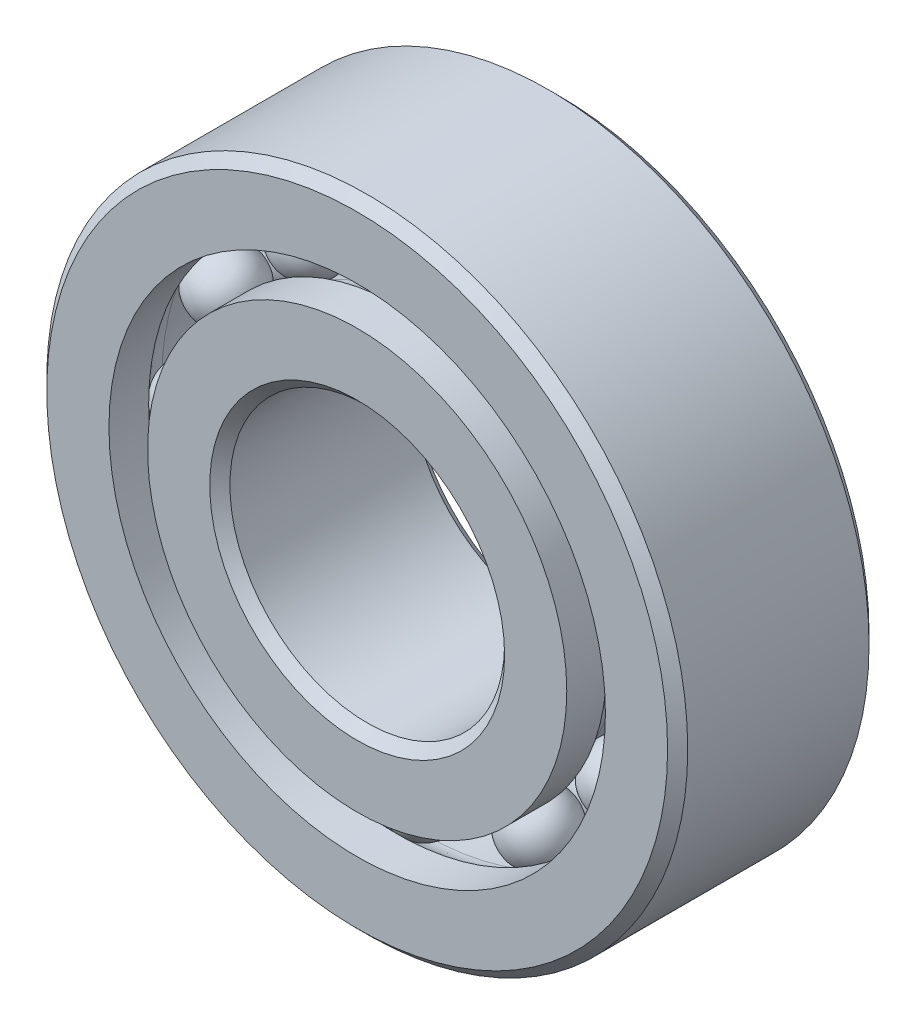
ISO-10303-21;
HEADER;
FILE_DESCRIPTION(('STEP AP214'),'2;1');
FILE_NAME('part.step','',(''),(''),'','','');
FILE_SCHEMA(('AUTOMOTIVE_DESIGN { 1 0 10303 214 1 1 1 1 }'));
ENDSEC;
DATA;
#1=APPLICATION_CONTEXT('core data for automotive mechanical design processes');
#2=APPLICATION_PROTOCOL_DEFINITION('international standard','automotive_design',2000,#1);
#3=PRODUCT_CONTEXT('',#1,'mechanical');
#4=PRODUCT('Part','Part','',(#3));
#5=PRODUCT_RELATED_PRODUCT_CATEGORY('part','',(#4));
#6=PRODUCT_DEFINITION_FORMATION('','',#4);
#7=PRODUCT_DEFINITION_CONTEXT('part definition',#1,'design');
#8=PRODUCT_DEFINITION('design','',#6,#7);
#9=PRODUCT_DEFINITION_SHAPE('','',#8);
#10=(LENGTH_UNIT() NAMED_UNIT(*) SI_UNIT(.MILLI.,.METRE.));
#11=(NAMED_UNIT(*) PLANE_ANGLE_UNIT() SI_UNIT($,.RADIAN.));
#12=(NAMED_UNIT(*) SI_UNIT($,.STERADIAN.) SOLID_ANGLE_UNIT());
#13=UNCERTAINTY_MEASURE_WITH_UNIT(LENGTH_MEASURE(1.E-05),#10,'distance_accuracy_value','');
#14=(GEOMETRIC_REPRESENTATION_CONTEXT(3) GLOBAL_UNCERTAINTY_ASSIGNED_CONTEXT((#13)) GLOBAL_UNIT_ASSIGNED_CONTEXT((#10,
#11,#12)) REPRESENTATION_CONTEXT('',''));
#15=CARTESIAN_POINT('',(0.,0.,0.));
#16=DIRECTION('',(0.,0.,1.));
#17=DIRECTION('',(1.,0.,0.));
#18=AXIS2_PLACEMENT_3D('',#15,#16,#17);
#19=CARTESIAN_POINT('',(-6.24999999999986,10.8253175473056,-1.83333333333333));
#20=DIRECTION('',(0.,0.,1.));
#21=DIRECTION('',(-0.499999999999989,0.866025403784445,0.));
#22=AXIS2_PLACEMENT_3D('',#19,#20,#21);
#23=SPHERICAL_SURFACE('',#22,1.83333333333333);
#24=CARTESIAN_POINT('',(-6.24999999999986,10.8253175473056,0.));
#25=VERTEX_POINT('',#24);
#26=VERTEX_LOOP('',#25);
#27=FACE_BOUND('',#26,.T.);
#28=ADVANCED_FACE('F42',(#27),#23,.T.);
#29=CLOSED_SHELL('',(#28));
#30=MANIFOLD_SOLID_BREP('B2',#29);
#31=CARTESIAN_POINT('',(-10.8253175473054,6.25000000000013,-1.83333333333333));
#32=DIRECTION('',(0.,0.,1.));
#33=DIRECTION('',(-0.866025403784433,0.50000000000001,0.));
#34=AXIS2_PLACEMENT_3D('',#31,#32,#33);
#35=SPHERICAL_SURFACE('',#34,1.83333333333333);
#36=CARTESIAN_POINT('',(-10.8253175473054,6.25000000000013,0.));
#37=VERTEX_POINT('',#36);
#38=VERTEX_LOOP('',#37);
#39=FACE_BOUND('',#38,.T.);
#40=ADVANCED_FACE('F63',(#39),#35,.T.);
#41=CLOSED_SHELL('',(#40));
#42=MANIFOLD_SOLID_BREP('B6',#41);
#43=CARTESIAN_POINT('',(-12.5,1.30930550206618E-13,-1.83333333333333));
#44=DIRECTION('',(0.,0.,1.));
#45=DIRECTION('',(-1.,0.,0.));
#46=AXIS2_PLACEMENT_3D('',#43,#44,#45);
#47=SPHERICAL_SURFACE('',#46,1.83333333333333);
#48=CARTESIAN_POINT('',(-12.5,1.30930550206618E-13,0.));
#49=VERTEX_POINT('',#48);
#50=VERTEX_LOOP('',#49);
#51=FACE_BOUND('',#50,.T.);
#52=ADVANCED_FACE('F84',(#51),#47,.T.);
#53=CLOSED_SHELL('',(#52));
#54=MANIFOLD_SOLID_BREP('B38',#53);
#55=CARTESIAN_POINT('',(-10.8253175473055,-6.2499999999999,-1.83333333333333));
#56=DIRECTION('',(0.,0.,1.));
#57=DIRECTION('',(-0.866025403784443,-0.499999999999992,0.));
#58=AXIS2_PLACEMENT_3D('',#55,#56,#57);
#59=SPHERICAL_SURFACE('',#58,1.83333333333333);
#60=CARTESIAN_POINT('',(-10.8253175473055,-6.2499999999999,0.));
#61=VERTEX_POINT('',#60);
#62=VERTEX_LOOP('',#61);
#63=FACE_BOUND('',#62,.T.);
#64=ADVANCED_FACE('F105',(#63),#59,.T.);
#65=CLOSED_SHELL('',(#64));
#66=MANIFOLD_SOLID_BREP('B59',#65);
#67=CARTESIAN_POINT('',(-6.25000000000009,-10.8253175473054,-1.83333333333333));
#68=DIRECTION('',(0.,0.,1.));
#69=DIRECTION('',(-0.500000000000007,-0.866025403784435,0.));
#70=AXIS2_PLACEMENT_3D('',#67,#68,#69);
#71=SPHERICAL_SURFACE('',#70,1.83333333333333);
#72=CARTESIAN_POINT('',(-6.25000000000009,-10.8253175473054,0.));
#73=VERTEX_POINT('',#72);
#74=VERTEX_LOOP('',#73);
#75=FACE_BOUND('',#74,.T.);
#76=ADVANCED_FACE('F126',(#75),#71,.T.);
#77=CLOSED_SHELL('',(#76));
#78=MANIFOLD_SOLID_BREP('B80',#77);
#79=CARTESIAN_POINT('',(0.,-12.5,-1.83333333333333));
#80=DIRECTION('',(0.,0.,1.));
#81=DIRECTION('',(0.,-1.,0.));
#82=AXIS2_PLACEMENT_3D('',#79,#80,#81);
#83=SPHERICAL_SURFACE('',#82,1.83333333333333);
#84=CARTESIAN_POINT('',(0.,-12.5,0.));
#85=VERTEX_POINT('',#84);
#86=VERTEX_LOOP('',#85);
#87=FACE_BOUND('',#86,.T.);
#88=ADVANCED_FACE('F147',(#87),#83,.T.);
#89=CLOSED_SHELL('',(#88));
#90=MANIFOLD_SOLID_BREP('B101',#89);
#91=CARTESIAN_POINT('',(6.24999999999994,-10.8253175473055,-1.83333333333333));
#92=DIRECTION('',(0.,0.,1.));
#93=DIRECTION('',(0.499999999999995,-0.866025403784442,0.));
#94=AXIS2_PLACEMENT_3D('',#91,#92,#93);
#95=SPHERICAL_SURFACE('',#94,1.83333333333333);
#96=CARTESIAN_POINT('',(6.24999999999994,-10.8253175473055,0.));
#97=VERTEX_POINT('',#96);
#98=VERTEX_LOOP('',#97);
#99=FACE_BOUND('',#98,.T.);
#100=ADVANCED_FACE('F168',(#99),#95,.T.);
#101=CLOSED_SHELL('',(#100));
#102=MANIFOLD_SOLID_BREP('B122',#101);
#103=CARTESIAN_POINT('',(10.8253175473055,-6.25000000000005,-1.83333333333333));
#104=DIRECTION('',(0.,0.,1.));
#105=DIRECTION('',(0.866025403784436,-0.500000000000004,0.));
#106=AXIS2_PLACEMENT_3D('',#103,#104,#105);
#107=SPHERICAL_SURFACE('',#106,1.83333333333333);
#108=CARTESIAN_POINT('',(10.8253175473055,-6.25000000000005,0.));
#109=VERTEX_POINT('',#108);
#110=VERTEX_LOOP('',#109);
#111=FACE_BOUND('',#110,.T.);
#112=ADVANCED_FACE('F189',(#111),#107,.T.);
#113=CLOSED_SHELL('',(#112));
#114=MANIFOLD_SOLID_BREP('B143',#113);
#115=CARTESIAN_POINT('',(12.5,0.,-1.83333333333333));
#116=DIRECTION('',(0.,0.,1.));
#117=DIRECTION('',(1.,0.,0.));
#118=AXIS2_PLACEMENT_3D('',#115,#116,#117);
#119=SPHERICAL_SURFACE('',#118,1.83333333333333);
#120=CARTESIAN_POINT('',(12.5,0.,0.));
#121=VERTEX_POINT('',#120);
#122=VERTEX_LOOP('',#121);
#123=FACE_BOUND('',#122,.T.);
#124=ADVANCED_FACE('F210',(#123),#119,.T.);
#125=CLOSED_SHELL('',(#124));
#126=MANIFOLD_SOLID_BREP('B164',#125);
#127=CARTESIAN_POINT('',(10.8253175473055,6.24999999999998,-1.83333333333333));
#128=DIRECTION('',(0.,0.,1.));
#129=DIRECTION('',(0.86602540378444,0.499999999999998,0.));
#130=AXIS2_PLACEMENT_3D('',#127,#128,#129);
#131=SPHERICAL_SURFACE('',#130,1.83333333333333);
#132=CARTESIAN_POINT('',(10.8253175473055,6.24999999999998,0.));
#133=VERTEX_POINT('',#132);
#134=VERTEX_LOOP('',#133);
#135=FACE_BOUND('',#134,.T.);
#136=ADVANCED_FACE('F231',(#135),#131,.T.);
#137=CLOSED_SHELL('',(#136));
#138=MANIFOLD_SOLID_BREP('B185',#137);
#139=CARTESIAN_POINT('',(6.25000000000001,10.8253175473055,-1.83333333333333));
#140=DIRECTION('',(0.,0.,1.));
#141=DIRECTION('',(0.500000000000001,0.866025403784438,0.));
#142=AXIS2_PLACEMENT_3D('',#139,#140,#141);
#143=SPHERICAL_SURFACE('',#142,1.83333333333333);
#144=CARTESIAN_POINT('',(6.25000000000001,10.8253175473055,0.));
#145=VERTEX_POINT('',#144);
#146=VERTEX_LOOP('',#145);
#147=FACE_BOUND('',#146,.T.);
#148=ADVANCED_FACE('F252',(#147),#143,.T.);
#149=CLOSED_SHELL('',(#148));
#150=MANIFOLD_SOLID_BREP('B206',#149);
#151=CARTESIAN_POINT('',(-6.24999999999986,10.8253175473056,1.83333333333333));
#152=DIRECTION('',(0.,0.,-1.));
#153=DIRECTION('',(-0.499999999999989,0.866025403784445,0.));
#154=AXIS2_PLACEMENT_3D('',#151,#152,#153);
#155=SPHERICAL_SURFACE('',#154,1.83333333333333);
#156=CARTESIAN_POINT('',(-6.24999999999986,10.8253175473056,0.));
#157=VERTEX_POINT('',#156);
#158=VERTEX_LOOP('',#157);
#159=FACE_BOUND('',#158,.T.);
#160=ADVANCED_FACE('F273',(#159),#155,.T.);
#161=CLOSED_SHELL('',(#160));
#162=MANIFOLD_SOLID_BREP('B227',#161);
#163=CARTESIAN_POINT('',(-10.8253175473054,6.25000000000013,1.83333333333333));
#164=DIRECTION('',(0.,0.,-1.));
#165=DIRECTION('',(-0.866025403784433,0.50000000000001,0.));
#166=AXIS2_PLACEMENT_3D('',#163,#164,#165);
#167=SPHERICAL_SURFACE('',#166,1.83333333333333);
#168=CARTESIAN_POINT('',(-10.8253175473054,6.25000000000013,0.));
#169=VERTEX_POINT('',#168);
#170=VERTEX_LOOP('',#169);
#171=FACE_BOUND('',#170,.T.);
#172=ADVANCED_FACE('F294',(#171),#167,.T.);
#173=CLOSED_SHELL('',(#172));
#174=MANIFOLD_SOLID_BREP('B248',#173);
#175=CARTESIAN_POINT('',(-12.5,1.30930550206618E-13,1.83333333333333));
#176=DIRECTION('',(0.,0.,-1.));
#177=DIRECTION('',(-1.,0.,0.));
#178=AXIS2_PLACEMENT_3D('',#175,#176,#177);
#179=SPHERICAL_SURFACE('',#178,1.83333333333333);
#180=CARTESIAN_POINT('',(-12.5,1.30930550206618E-13,0.));
#181=VERTEX_POINT('',#180);
#182=VERTEX_LOOP('',#181);
#183=FACE_BOUND('',#182,.T.);
#184=ADVANCED_FACE('F315',(#183),#179,.T.);
#185=CLOSED_SHELL('',(#184));
#186=MANIFOLD_SOLID_BREP('B269',#185);
#187=CARTESIAN_POINT('',(-10.8253175473055,-6.2499999999999,1.83333333333333));
#188=DIRECTION('',(0.,0.,-1.));
#189=DIRECTION('',(-0.866025403784443,-0.499999999999992,0.));
#190=AXIS2_PLACEMENT_3D('',#187,#188,#189);
#191=SPHERICAL_SURFACE('',#190,1.83333333333333);
#192=CARTESIAN_POINT('',(-10.8253175473055,-6.2499999999999,0.));
#193=VERTEX_POINT('',#192);
#194=VERTEX_LOOP('',#193);
#195=FACE_BOUND('',#194,.T.);
#196=ADVANCED_FACE('F336',(#195),#191,.T.);
#197=CLOSED_SHELL('',(#196));
#198=MANIFOLD_SOLID_BREP('B290',#197);
#199=CARTESIAN_POINT('',(-6.25000000000009,-10.8253175473054,1.83333333333333));
#200=DIRECTION('',(0.,0.,-1.));
#201=DIRECTION('',(-0.500000000000007,-0.866025403784435,0.));
#202=AXIS2_PLACEMENT_3D('',#199,#200,#201);
#203=SPHERICAL_SURFACE('',#202,1.83333333333333);
#204=CARTESIAN_POINT('',(-6.25000000000009,-10.8253175473054,0.));
#205=VERTEX_POINT('',#204);
#206=VERTEX_LOOP('',#205);
#207=FACE_BOUND('',#206,.T.);
#208=ADVANCED_FACE('F357',(#207),#203,.T.);
#209=CLOSED_SHELL('',(#208));
#210=MANIFOLD_SOLID_BREP('B311',#209);
#211=CARTESIAN_POINT('',(0.,-12.5,1.83333333333333));
#212=DIRECTION('',(0.,0.,-1.));
#213=DIRECTION('',(0.,-1.,0.));
#214=AXIS2_PLACEMENT_3D('',#211,#212,#213);
#215=SPHERICAL_SURFACE('',#214,1.83333333333333);
#216=CARTESIAN_POINT('',(0.,-12.5,0.));
#217=VERTEX_POINT('',#216);
#218=VERTEX_LOOP('',#217);
#219=FACE_BOUND('',#218,.T.);
#220=ADVANCED_FACE('F378',(#219),#215,.T.);
#221=CLOSED_SHELL('',(#220));
#222=MANIFOLD_SOLID_BREP('B332',#221);
#223=CARTESIAN_POINT('',(6.24999999999994,-10.8253175473055,1.83333333333333));
#224=DIRECTION('',(0.,0.,-1.));
#225=DIRECTION('',(0.499999999999995,-0.866025403784442,0.));
#226=AXIS2_PLACEMENT_3D('',#223,#224,#225);
#227=SPHERICAL_SURFACE('',#226,1.83333333333333);
#228=CARTESIAN_POINT('',(6.24999999999994,-10.8253175473055,0.));
#229=VERTEX_POINT('',#228);
#230=VERTEX_LOOP('',#229);
#231=FACE_BOUND('',#230,.T.);
#232=ADVANCED_FACE('F399',(#231),#227,.T.);
#233=CLOSED_SHELL('',(#232));
#234=MANIFOLD_SOLID_BREP('B353',#233);
#235=CARTESIAN_POINT('',(10.8253175473055,-6.25000000000005,1.83333333333333));
#236=DIRECTION('',(0.,0.,-1.));
#237=DIRECTION('',(0.866025403784436,-0.500000000000004,0.));
#238=AXIS2_PLACEMENT_3D('',#235,#236,#237);
#239=SPHERICAL_SURFACE('',#238,1.83333333333333);
#240=CARTESIAN_POINT('',(10.8253175473055,-6.25000000000005,0.));
#241=VERTEX_POINT('',#240);
#242=VERTEX_LOOP('',#241);
#243=FACE_BOUND('',#242,.T.);
#244=ADVANCED_FACE('F420',(#243),#239,.T.);
#245=CLOSED_SHELL('',(#244));
#246=MANIFOLD_SOLID_BREP('B374',#245);
#247=CARTESIAN_POINT('',(12.5,0.,1.83333333333333));
#248=DIRECTION('',(0.,0.,-1.));
#249=DIRECTION('',(1.,0.,0.));
#250=AXIS2_PLACEMENT_3D('',#247,#248,#249);
#251=SPHERICAL_SURFACE('',#250,1.83333333333333);
#252=CARTESIAN_POINT('',(12.5,0.,0.));
#253=VERTEX_POINT('',#252);
#254=VERTEX_LOOP('',#253);
#255=FACE_BOUND('',#254,.T.);
#256=ADVANCED_FACE('F441',(#255),#251,.T.);
#257=CLOSED_SHELL('',(#256));
#258=MANIFOLD_SOLID_BREP('B395',#257);
#259=CARTESIAN_POINT('',(10.8253175473055,6.24999999999998,1.83333333333333));
#260=DIRECTION('',(0.,0.,-1.));
#261=DIRECTION('',(0.86602540378444,0.499999999999998,0.));
#262=AXIS2_PLACEMENT_3D('',#259,#260,#261);
#263=SPHERICAL_SURFACE('',#262,1.83333333333333);
#264=CARTESIAN_POINT('',(10.8253175473055,6.24999999999998,0.));
#265=VERTEX_POINT('',#264);
#266=VERTEX_LOOP('',#265);
#267=FACE_BOUND('',#266,.T.);
#268=ADVANCED_FACE('F462',(#267),#263,.T.);
#269=CLOSED_SHELL('',(#268));
#270=MANIFOLD_SOLID_BREP('B416',#269);
#271=CARTESIAN_POINT('',(6.25000000000001,10.8253175473055,1.83333333333333));
#272=DIRECTION('',(0.,0.,-1.));
#273=DIRECTION('',(0.500000000000001,0.866025403784438,0.));
#274=AXIS2_PLACEMENT_3D('',#271,#272,#273);
#275=SPHERICAL_SURFACE('',#274,1.83333333333333);
#276=CARTESIAN_POINT('',(6.25000000000001,10.8253175473055,0.));
#277=VERTEX_POINT('',#276);
#278=VERTEX_LOOP('',#277);
#279=FACE_BOUND('',#278,.T.);
#280=ADVANCED_FACE('F483',(#279),#275,.T.);
#281=CLOSED_SHELL('',(#280));
#282=MANIFOLD_SOLID_BREP('B437',#281);
#283=CARTESIAN_POINT('',(0.,12.5,1.83333333333333));
#284=DIRECTION('',(0.,0.,-1.));
#285=DIRECTION('',(0.,1.,0.));
#286=AXIS2_PLACEMENT_3D('',#283,#284,#285);
#287=SPHERICAL_SURFACE('',#286,1.83333333333333);
#288=CARTESIAN_POINT('',(0.,12.5,0.));
#289=VERTEX_POINT('',#288);
#290=VERTEX_LOOP('',#289);
#291=FACE_BOUND('',#290,.T.);
#292=ADVANCED_FACE('F504',(#291),#287,.T.);
#293=CLOSED_SHELL('',(#292));
#294=MANIFOLD_SOLID_BREP('B458',#293);
#295=CARTESIAN_POINT('',(0.,12.5,-1.83333333333333));
#296=DIRECTION('',(0.,0.,1.));
#297=DIRECTION('',(0.,1.,0.));
#298=AXIS2_PLACEMENT_3D('',#295,#296,#297);
#299=SPHERICAL_SURFACE('',#298,1.83333333333333);
#300=CARTESIAN_POINT('',(0.,12.5,0.));
#301=VERTEX_POINT('',#300);
#302=VERTEX_LOOP('',#301);
#303=FACE_BOUND('',#302,.T.);
#304=ADVANCED_FACE('F527',(#303),#299,.T.);
#305=CLOSED_SHELL('',(#304));
#306=MANIFOLD_SOLID_BREP('B479',#305);
#307=CARTESIAN_POINT('',(0.,11.4450549450549,5.5));
#308=DIRECTION('',(0.,0.,-1.));
#309=DIRECTION('',(-1.,0.,0.));
#310=AXIS2_PLACEMENT_3D('',#307,#308,#309);
#311=PLANE('',#310);
#312=CARTESIAN_POINT('',(0.,0.,5.5));
#313=DIRECTION('',(0.,0.,1.));
#314=DIRECTION('',(1.,0.,0.));
#315=AXIS2_PLACEMENT_3D('',#312,#313,#314);
#316=CIRCLE('',#315,8.05);
#317=CARTESIAN_POINT('',(8.05,0.,5.5));
#318=VERTEX_POINT('',#317);
#319=EDGE_CURVE('E526',#318,#318,#316,.T.);
#320=ORIENTED_EDGE('',*,*,#319,.F.);
#321=EDGE_LOOP('',(#320));
#322=FACE_BOUND('',#321,.T.);
#323=CARTESIAN_POINT('',(0.,0.,5.5));
#324=DIRECTION('',(0.,0.,1.));
#325=DIRECTION('',(1.,0.,0.));
#326=AXIS2_PLACEMENT_3D('',#323,#324,#325);
#327=CIRCLE('',#326,11.4450549450549);
#328=CARTESIAN_POINT('',(11.4450549450549,0.,5.5));
#329=VERTEX_POINT('',#328);
#330=EDGE_CURVE('E581',#329,#329,#327,.T.);
#331=ORIENTED_EDGE('',*,*,#330,.T.);
#332=EDGE_LOOP('',(#331));
#333=FACE_BOUND('',#332,.T.);
#334=ADVANCED_FACE('F547',(#322,#333),#311,.F.);
#335=CARTESIAN_POINT('',(0.,0.,5.5));
#336=DIRECTION('',(0.,0.,1.));
#337=DIRECTION('',(1.,0.,0.));
#338=AXIS2_PLACEMENT_3D('',#335,#336,#337);
#339=CONICAL_SURFACE('',#338,8.05,0.78539816339745);
#340=CARTESIAN_POINT('',(0.,0.,4.95));
#341=DIRECTION('',(0.,0.,1.));
#342=DIRECTION('',(1.,0.,0.));
#343=AXIS2_PLACEMENT_3D('',#340,#341,#342);
#344=CIRCLE('',#343,7.5);
#345=CARTESIAN_POINT('',(7.5,0.,4.95));
#346=VERTEX_POINT('',#345);
#347=EDGE_CURVE('E553',#346,#346,#344,.T.);
#348=ORIENTED_EDGE('',*,*,#347,.F.);
#349=EDGE_LOOP('',(#348));
#350=FACE_BOUND('',#349,.T.);
#351=ORIENTED_EDGE('',*,*,#319,.T.);
#352=EDGE_LOOP('',(#351));
#353=FACE_BOUND('',#352,.T.);
#354=ADVANCED_FACE('F630',(#350,#353),#339,.F.);
#355=CARTESIAN_POINT('',(0.,0.,5.5));
#356=DIRECTION('',(0.,0.,1.));
#357=DIRECTION('',(1.,0.,0.));
#358=AXIS2_PLACEMENT_3D('',#355,#356,#357);
#359=CYLINDRICAL_SURFACE('',#358,7.5);
#360=CARTESIAN_POINT('',(0.,0.,-4.95));
#361=DIRECTION('',(0.,0.,1.));
#362=DIRECTION('',(1.,0.,0.));
#363=AXIS2_PLACEMENT_3D('',#360,#361,#362);
#364=CIRCLE('',#363,7.5);
#365=CARTESIAN_POINT('',(7.5,0.,-4.95));
#366=VERTEX_POINT('',#365);
#367=EDGE_CURVE('E557',#366,#366,#364,.T.);
#368=ORIENTED_EDGE('',*,*,#367,.F.);
#369=EDGE_LOOP('',(#368));
#370=FACE_BOUND('',#369,.T.);
#371=ORIENTED_EDGE('',*,*,#347,.T.);
#372=EDGE_LOOP('',(#371));
#373=FACE_BOUND('',#372,.T.);
#374=ADVANCED_FACE('F625',(#370,#373),#359,.F.);
#375=CARTESIAN_POINT('',(0.,0.,-4.95));
#376=DIRECTION('',(0.,0.,-1.));
#377=DIRECTION('',(-1.,0.,0.));
#378=AXIS2_PLACEMENT_3D('',#375,#376,#377);
#379=CONICAL_SURFACE('',#378,7.5,0.78539816339745);
#380=CARTESIAN_POINT('',(0.,0.,-5.5));
#381=DIRECTION('',(0.,0.,1.));
#382=DIRECTION('',(1.,0.,0.));
#383=AXIS2_PLACEMENT_3D('',#380,#381,#382);
#384=CIRCLE('',#383,8.05);
#385=CARTESIAN_POINT('',(8.05,0.,-5.5));
#386=VERTEX_POINT('',#385);
#387=EDGE_CURVE('E561',#386,#386,#384,.T.);
#388=ORIENTED_EDGE('',*,*,#387,.F.);
#389=EDGE_LOOP('',(#388));
#390=FACE_BOUND('',#389,.T.);
#391=ORIENTED_EDGE('',*,*,#367,.T.);
#392=EDGE_LOOP('',(#391));
#393=FACE_BOUND('',#392,.T.);
#394=ADVANCED_FACE('F619',(#390,#393),#379,.F.);
#395=CARTESIAN_POINT('',(0.,8.05,-5.5));
#396=DIRECTION('',(0.,0.,1.));
#397=DIRECTION('',(1.,0.,0.));
#398=AXIS2_PLACEMENT_3D('',#395,#396,#397);
#399=PLANE('',#398);
#400=CARTESIAN_POINT('',(0.,0.,-5.5));
#401=DIRECTION('',(0.,0.,1.));
#402=DIRECTION('',(1.,0.,0.));
#403=AXIS2_PLACEMENT_3D('',#400,#401,#402);
#404=CIRCLE('',#403,11.445054945055);
#405=CARTESIAN_POINT('',(11.445054945055,0.,-5.5));
#406=VERTEX_POINT('',#405);
#407=EDGE_CURVE('E566',#406,#406,#404,.T.);
#408=ORIENTED_EDGE('',*,*,#407,.F.);
#409=EDGE_LOOP('',(#408));
#410=FACE_BOUND('',#409,.T.);
#411=ORIENTED_EDGE('',*,*,#387,.T.);
#412=EDGE_LOOP('',(#411));
#413=FACE_BOUND('',#412,.T.);
#414=ADVANCED_FACE('F613',(#410,#413),#399,.F.);
#415=CARTESIAN_POINT('',(0.,0.,5.5));
#416=DIRECTION('',(0.,0.,1.));
#417=DIRECTION('',(1.,0.,0.));
#418=AXIS2_PLACEMENT_3D('',#415,#416,#417);
#419=CYLINDRICAL_SURFACE('',#418,11.445054945055);
#420=CARTESIAN_POINT('',(0.,0.,-3.33273389427697));
#421=DIRECTION('',(0.,0.,1.));
#422=DIRECTION('',(1.,0.,0.));
#423=AXIS2_PLACEMENT_3D('',#420,#421,#422);
#424=CIRCLE('',#423,11.445054945055);
#425=CARTESIAN_POINT('',(11.445054945055,0.,-3.33273389427697));
#426=VERTEX_POINT('',#425);
#427=EDGE_CURVE('E569',#426,#426,#424,.T.);
#428=ORIENTED_EDGE('',*,*,#427,.F.);
#429=EDGE_LOOP('',(#428));
#430=FACE_BOUND('',#429,.T.);
#431=ORIENTED_EDGE('',*,*,#407,.T.);
#432=EDGE_LOOP('',(#431));
#433=FACE_BOUND('',#432,.T.);
#434=ADVANCED_FACE('F607',(#430,#433),#419,.T.);
#435=CARTESIAN_POINT('',(0.,0.,-1.83333333333333));
#436=DIRECTION('',(0.,0.,1.));
#437=DIRECTION('',(1.,0.,0.));
#438=AXIS2_PLACEMENT_3D('',#435,#436,#437);
#439=TOROIDAL_SURFACE('',#438,12.5,1.83333333333333);
#440=CARTESIAN_POINT('',(0.,0.,-1.83333333333333));
#441=DIRECTION('',(0.,0.,1.));
#442=DIRECTION('',(1.,0.,0.));
#443=AXIS2_PLACEMENT_3D('',#440,#441,#442);
#444=CIRCLE('',#443,10.6666666666667);
#445=CARTESIAN_POINT('',(10.6666666666667,0.,-1.83333333333333));
#446=VERTEX_POINT('',#445);
#447=EDGE_CURVE('E572',#446,#446,#444,.T.);
#448=ORIENTED_EDGE('',*,*,#447,.F.);
#449=EDGE_LOOP('',(#448));
#450=FACE_BOUND('',#449,.T.);
#451=ORIENTED_EDGE('',*,*,#427,.T.);
#452=EDGE_LOOP('',(#451));
#453=FACE_BOUND('',#452,.T.);
#454=ADVANCED_FACE('F601',(#450,#453),#439,.F.);
#455=CARTESIAN_POINT('',(0.,0.,5.5));
#456=DIRECTION('',(0.,0.,1.));
#457=DIRECTION('',(1.,0.,0.));
#458=AXIS2_PLACEMENT_3D('',#455,#456,#457);
#459=CYLINDRICAL_SURFACE('',#458,10.6666666666667);
#460=CARTESIAN_POINT('',(0.,0.,1.83333333333333));
#461=DIRECTION('',(0.,0.,1.));
#462=DIRECTION('',(1.,0.,0.));
#463=AXIS2_PLACEMENT_3D('',#460,#461,#462);
#464=CIRCLE('',#463,10.6666666666667);
#465=CARTESIAN_POINT('',(10.6666666666667,0.,1.83333333333333));
#466=VERTEX_POINT('',#465);
#467=EDGE_CURVE('E575',#466,#466,#464,.T.);
#468=ORIENTED_EDGE('',*,*,#467,.F.);
#469=EDGE_LOOP('',(#468));
#470=FACE_BOUND('',#469,.T.);
#471=ORIENTED_EDGE('',*,*,#447,.T.);
#472=EDGE_LOOP('',(#471));
#473=FACE_BOUND('',#472,.T.);
#474=ADVANCED_FACE('F595',(#470,#473),#459,.T.);
#475=CARTESIAN_POINT('',(0.,0.,1.83333333333333));
#476=DIRECTION('',(0.,0.,1.));
#477=DIRECTION('',(1.,0.,0.));
#478=AXIS2_PLACEMENT_3D('',#475,#476,#477);
#479=TOROIDAL_SURFACE('',#478,12.5,1.83333333333333);
#480=CARTESIAN_POINT('',(0.,0.,3.33273389427697));
#481=DIRECTION('',(0.,0.,1.));
#482=DIRECTION('',(1.,0.,0.));
#483=AXIS2_PLACEMENT_3D('',#480,#481,#482);
#484=CIRCLE('',#483,11.4450549450549);
#485=CARTESIAN_POINT('',(11.4450549450549,0.,3.33273389427697));
#486=VERTEX_POINT('',#485);
#487=EDGE_CURVE('E578',#486,#486,#484,.T.);
#488=ORIENTED_EDGE('',*,*,#487,.F.);
#489=EDGE_LOOP('',(#488));
#490=FACE_BOUND('',#489,.T.);
#491=ORIENTED_EDGE('',*,*,#467,.T.);
#492=EDGE_LOOP('',(#491));
#493=FACE_BOUND('',#492,.T.);
#494=ADVANCED_FACE('F589',(#490,#493),#479,.F.);
#495=CARTESIAN_POINT('',(0.,0.,5.5));
#496=DIRECTION('',(0.,0.,1.));
#497=DIRECTION('',(1.,0.,0.));
#498=AXIS2_PLACEMENT_3D('',#495,#496,#497);
#499=CYLINDRICAL_SURFACE('',#498,11.4450549450549);
#500=ORIENTED_EDGE('',*,*,#330,.F.);
#501=EDGE_LOOP('',(#500));
#502=FACE_BOUND('',#501,.T.);
#503=ORIENTED_EDGE('',*,*,#487,.T.);
#504=EDGE_LOOP('',(#503));
#505=FACE_BOUND('',#504,.T.);
#506=ADVANCED_FACE('F586',(#502,#505),#499,.T.);
#507=CLOSED_SHELL('',(#334,#354,#374,#394,#414,#434,#454,#474,#494,#506));
#508=MANIFOLD_SOLID_BREP('B500',#507);
#509=CARTESIAN_POINT('',(0.,0.,4.95));
#510=DIRECTION('',(0.,0.,-1.));
#511=DIRECTION('',(-1.,0.,0.));
#512=AXIS2_PLACEMENT_3D('',#509,#510,#511);
#513=CONICAL_SURFACE('',#512,17.5,0.785398163397447);
#514=CARTESIAN_POINT('',(0.,0.,5.5));
#515=DIRECTION('',(0.,0.,1.));
#516=DIRECTION('',(1.,0.,0.));
#517=AXIS2_PLACEMENT_3D('',#514,#515,#516);
#518=CIRCLE('',#517,16.95);
#519=CARTESIAN_POINT('',(16.95,0.,5.5));
#520=VERTEX_POINT('',#519);
#521=EDGE_CURVE('E546',#520,#520,#518,.T.);
#522=ORIENTED_EDGE('',*,*,#521,.F.);
#523=EDGE_LOOP('',(#522));
#524=FACE_BOUND('',#523,.T.);
#525=CARTESIAN_POINT('',(0.,0.,4.95));
#526=DIRECTION('',(0.,0.,1.));
#527=DIRECTION('',(1.,0.,0.));
#528=AXIS2_PLACEMENT_3D('',#525,#526,#527);
#529=CIRCLE('',#528,17.5);
#530=CARTESIAN_POINT('',(17.5,0.,4.95));
#531=VERTEX_POINT('',#530);
#532=EDGE_CURVE('E733',#531,#531,#529,.T.);
#533=ORIENTED_EDGE('',*,*,#532,.T.);
#534=EDGE_LOOP('',(#533));
#535=FACE_BOUND('',#534,.T.);
#536=ADVANCED_FACE('F699',(#524,#535),#513,.T.);
#537=CARTESIAN_POINT('',(0.,16.95,5.5));
#538=DIRECTION('',(0.,0.,-1.));
#539=DIRECTION('',(-1.,0.,0.));
#540=AXIS2_PLACEMENT_3D('',#537,#538,#539);
#541=PLANE('',#540);
#542=CARTESIAN_POINT('',(0.,0.,5.5));
#543=DIRECTION('',(0.,0.,1.));
#544=DIRECTION('',(1.,0.,0.));
#545=AXIS2_PLACEMENT_3D('',#542,#543,#544);
#546=CIRCLE('',#545,13.5549450549451);
#547=CARTESIAN_POINT('',(13.5549450549451,0.,5.5));
#548=VERTEX_POINT('',#547);
#549=EDGE_CURVE('E705',#548,#548,#546,.T.);
#550=ORIENTED_EDGE('',*,*,#549,.F.);
#551=EDGE_LOOP('',(#550));
#552=FACE_BOUND('',#551,.T.);
#553=ORIENTED_EDGE('',*,*,#521,.T.);
#554=EDGE_LOOP('',(#553));
#555=FACE_BOUND('',#554,.T.);
#556=ADVANCED_FACE('F782',(#552,#555),#541,.F.);
#557=CARTESIAN_POINT('',(0.,0.,5.5));
#558=DIRECTION('',(0.,0.,1.));
#559=DIRECTION('',(1.,0.,0.));
#560=AXIS2_PLACEMENT_3D('',#557,#558,#559);
#561=CYLINDRICAL_SURFACE('',#560,13.5549450549451);
#562=CARTESIAN_POINT('',(0.,0.,3.33273389427697));
#563=DIRECTION('',(0.,0.,1.));
#564=DIRECTION('',(1.,0.,0.));
#565=AXIS2_PLACEMENT_3D('',#562,#563,#564);
#566=CIRCLE('',#565,13.5549450549451);
#567=CARTESIAN_POINT('',(13.5549450549451,0.,3.33273389427697));
#568=VERTEX_POINT('',#567);
#569=EDGE_CURVE('E709',#568,#568,#566,.T.);
#570=ORIENTED_EDGE('',*,*,#569,.F.);
#571=EDGE_LOOP('',(#570));
#572=FACE_BOUND('',#571,.T.);
#573=ORIENTED_EDGE('',*,*,#549,.T.);
#574=EDGE_LOOP('',(#573));
#575=FACE_BOUND('',#574,.T.);
#576=ADVANCED_FACE('F777',(#572,#575),#561,.F.);
#577=CARTESIAN_POINT('',(0.,0.,1.83333333333333));
#578=DIRECTION('',(0.,0.,1.));
#579=DIRECTION('',(1.,0.,0.));
#580=AXIS2_PLACEMENT_3D('',#577,#578,#579);
#581=TOROIDAL_SURFACE('',#580,12.5,1.83333333333333);
#582=CARTESIAN_POINT('',(0.,0.,1.83333333333333));
#583=DIRECTION('',(0.,0.,1.));
#584=DIRECTION('',(1.,0.,0.));
#585=AXIS2_PLACEMENT_3D('',#582,#583,#584);
#586=CIRCLE('',#585,14.3333333333333);
#587=CARTESIAN_POINT('',(14.3333333333333,0.,1.83333333333333));
#588=VERTEX_POINT('',#587);
#589=EDGE_CURVE('E713',#588,#588,#586,.T.);
#590=ORIENTED_EDGE('',*,*,#589,.F.);
#591=EDGE_LOOP('',(#590));
#592=FACE_BOUND('',#591,.T.);
#593=ORIENTED_EDGE('',*,*,#569,.T.);
#594=EDGE_LOOP('',(#593));
#595=FACE_BOUND('',#594,.T.);
#596=ADVANCED_FACE('F771',(#592,#595),#581,.F.);
#597=CARTESIAN_POINT('',(0.,0.,5.5));
#598=DIRECTION('',(0.,0.,1.));
#599=DIRECTION('',(1.,0.,0.));
#600=AXIS2_PLACEMENT_3D('',#597,#598,#599);
#601=CYLINDRICAL_SURFACE('',#600,14.3333333333333);
#602=CARTESIAN_POINT('',(0.,0.,-1.83333333333333));
#603=DIRECTION('',(0.,0.,1.));
#604=DIRECTION('',(1.,0.,0.));
#605=AXIS2_PLACEMENT_3D('',#602,#603,#604);
#606=CIRCLE('',#605,14.3333333333333);
#607=CARTESIAN_POINT('',(14.3333333333333,0.,-1.83333333333333));
#608=VERTEX_POINT('',#607);
#609=EDGE_CURVE('E718',#608,#608,#606,.T.);
#610=ORIENTED_EDGE('',*,*,#609,.F.);
#611=EDGE_LOOP('',(#610));
#612=FACE_BOUND('',#611,.T.);
#613=ORIENTED_EDGE('',*,*,#589,.T.);
#614=EDGE_LOOP('',(#613));
#615=FACE_BOUND('',#614,.T.);
#616=ADVANCED_FACE('F765',(#612,#615),#601,.F.);
#617=CARTESIAN_POINT('',(0.,0.,-1.83333333333333));
#618=DIRECTION('',(0.,0.,1.));
#619=DIRECTION('',(1.,0.,0.));
#620=AXIS2_PLACEMENT_3D('',#617,#618,#619);
#621=TOROIDAL_SURFACE('',#620,12.5,1.83333333333333);
#622=CARTESIAN_POINT('',(0.,0.,-3.33273389427697));
#623=DIRECTION('',(0.,0.,1.));
#624=DIRECTION('',(1.,0.,0.));
#625=AXIS2_PLACEMENT_3D('',#622,#623,#624);
#626=CIRCLE('',#625,13.5549450549451);
#627=CARTESIAN_POINT('',(13.5549450549451,0.,-3.33273389427697));
#628=VERTEX_POINT('',#627);
#629=EDGE_CURVE('E721',#628,#628,#626,.T.);
#630=ORIENTED_EDGE('',*,*,#629,.F.);
#631=EDGE_LOOP('',(#630));
#632=FACE_BOUND('',#631,.T.);
#633=ORIENTED_EDGE('',*,*,#609,.T.);
#634=EDGE_LOOP('',(#633));
#635=FACE_BOUND('',#634,.T.);
#636=ADVANCED_FACE('F759',(#632,#635),#621,.F.);
#637=CARTESIAN_POINT('',(0.,0.,5.5));
#638=DIRECTION('',(0.,0.,1.));
#639=DIRECTION('',(1.,0.,0.));
#640=AXIS2_PLACEMENT_3D('',#637,#638,#639);
#641=CYLINDRICAL_SURFACE('',#640,13.5549450549451);
#642=CARTESIAN_POINT('',(0.,0.,-5.5));
#643=DIRECTION('',(0.,0.,1.));
#644=DIRECTION('',(1.,0.,0.));
#645=AXIS2_PLACEMENT_3D('',#642,#643,#644);
#646=CIRCLE('',#645,13.5549450549451);
#647=CARTESIAN_POINT('',(13.5549450549451,0.,-5.5));
#648=VERTEX_POINT('',#647);
#649=EDGE_CURVE('E724',#648,#648,#646,.T.);
#650=ORIENTED_EDGE('',*,*,#649,.F.);
#651=EDGE_LOOP('',(#650));
#652=FACE_BOUND('',#651,.T.);
#653=ORIENTED_EDGE('',*,*,#629,.T.);
#654=EDGE_LOOP('',(#653));
#655=FACE_BOUND('',#654,.T.);
#656=ADVANCED_FACE('F753',(#652,#655),#641,.F.);
#657=CARTESIAN_POINT('',(0.,16.95,-5.5));
#658=DIRECTION('',(0.,0.,1.));
#659=DIRECTION('',(1.,0.,0.));
#660=AXIS2_PLACEMENT_3D('',#657,#658,#659);
#661=PLANE('',#660);
#662=CARTESIAN_POINT('',(0.,0.,-5.5));
#663=DIRECTION('',(0.,0.,1.));
#664=DIRECTION('',(1.,0.,0.));
#665=AXIS2_PLACEMENT_3D('',#662,#663,#664);
#666=CIRCLE('',#665,16.95);
#667=CARTESIAN_POINT('',(16.95,0.,-5.5));
#668=VERTEX_POINT('',#667);
#669=EDGE_CURVE('E727',#668,#668,#666,.T.);
#670=ORIENTED_EDGE('',*,*,#669,.F.);
#671=EDGE_LOOP('',(#670));
#672=FACE_BOUND('',#671,.T.);
#673=ORIENTED_EDGE('',*,*,#649,.T.);
#674=EDGE_LOOP('',(#673));
#675=FACE_BOUND('',#674,.T.);
#676=ADVANCED_FACE('F747',(#672,#675),#661,.F.);
#677=CARTESIAN_POINT('',(0.,0.,-5.5));
#678=DIRECTION('',(0.,0.,1.));
#679=DIRECTION('',(1.,0.,0.));
#680=AXIS2_PLACEMENT_3D('',#677,#678,#679);
#681=CONICAL_SURFACE('',#680,16.95,0.785398163397447);
#682=CARTESIAN_POINT('',(0.,0.,-4.95));
#683=DIRECTION('',(0.,0.,1.));
#684=DIRECTION('',(1.,0.,0.));
#685=AXIS2_PLACEMENT_3D('',#682,#683,#684);
#686=CIRCLE('',#685,17.5);
#687=CARTESIAN_POINT('',(17.5,0.,-4.95));
#688=VERTEX_POINT('',#687);
#689=EDGE_CURVE('E730',#688,#688,#686,.T.);
#690=ORIENTED_EDGE('',*,*,#689,.F.);
#691=EDGE_LOOP('',(#690));
#692=FACE_BOUND('',#691,.T.);
#693=ORIENTED_EDGE('',*,*,#669,.T.);
#694=EDGE_LOOP('',(#693));
#695=FACE_BOUND('',#694,.T.);
#696=ADVANCED_FACE('F741',(#692,#695),#681,.T.);
#697=CARTESIAN_POINT('',(0.,0.,5.5));
#698=DIRECTION('',(0.,0.,1.));
#699=DIRECTION('',(1.,0.,0.));
#700=AXIS2_PLACEMENT_3D('',#697,#698,#699);
#701=CYLINDRICAL_SURFACE('',#700,17.5);
#702=ORIENTED_EDGE('',*,*,#532,.F.);
#703=EDGE_LOOP('',(#702));
#704=FACE_BOUND('',#703,.T.);
#705=ORIENTED_EDGE('',*,*,#689,.T.);
#706=EDGE_LOOP('',(#705));
#707=FACE_BOUND('',#706,.T.);
#708=ADVANCED_FACE('F738',(#704,#707),#701,.T.);
#709=CLOSED_SHELL('',(#536,#556,#576,#596,#616,#636,#656,#676,#696,#708));
#710=MANIFOLD_SOLID_BREP('B521',#709);
#711=ADVANCED_BREP_SHAPE_REPRESENTATION('',(#18,#30,#42,#54,#66,#78,#90,#102,#114,#126,#138,
#150,#162,#174,#186,#198,#210,#222,#234,#246,#258,#270,#282,#294,#306,#508,#710),#14);
#712=SHAPE_DEFINITION_REPRESENTATION(#9,#711);
ENDSEC;
END-ISO-10303-21;
